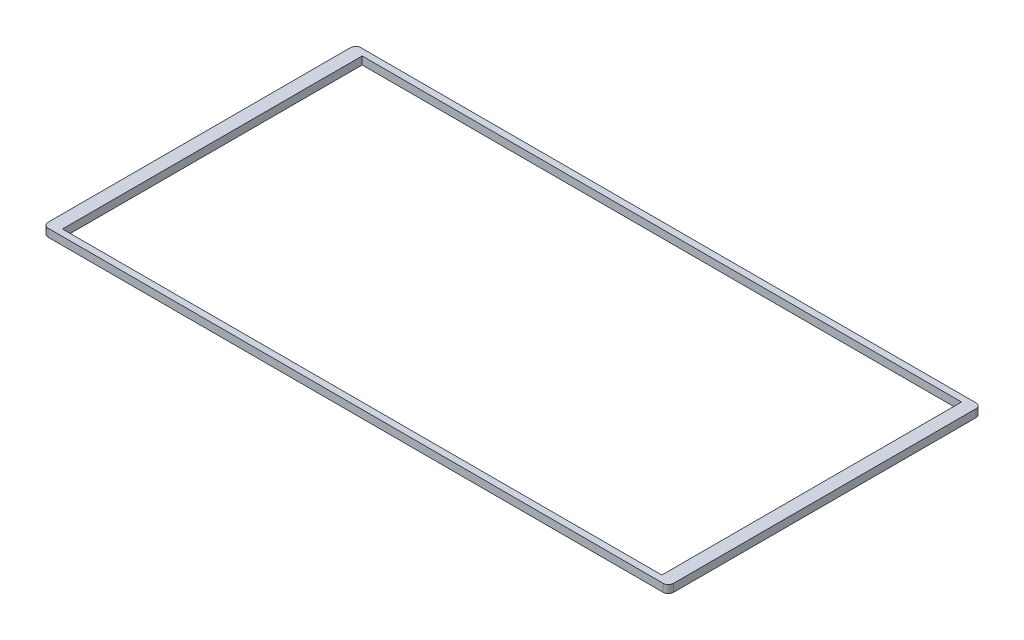
ISO-10303-21;
HEADER;
FILE_DESCRIPTION(('STEP AP214'),'2;1');
FILE_NAME('part.step','',(''),(''),'','','');
FILE_SCHEMA(('AUTOMOTIVE_DESIGN { 1 0 10303 214 1 1 1 1 }'));
ENDSEC;
DATA;
#1=APPLICATION_CONTEXT('core data for automotive mechanical design processes');
#2=APPLICATION_PROTOCOL_DEFINITION('international standard','automotive_design',2000,#1);
#3=PRODUCT_CONTEXT('',#1,'mechanical');
#4=PRODUCT('Part','Part','',(#3));
#5=PRODUCT_RELATED_PRODUCT_CATEGORY('part','',(#4));
#6=PRODUCT_DEFINITION_FORMATION('','',#4);
#7=PRODUCT_DEFINITION_CONTEXT('part definition',#1,'design');
#8=PRODUCT_DEFINITION('design','',#6,#7);
#9=PRODUCT_DEFINITION_SHAPE('','',#8);
#10=(LENGTH_UNIT() NAMED_UNIT(*) SI_UNIT(.MILLI.,.METRE.));
#11=(NAMED_UNIT(*) PLANE_ANGLE_UNIT() SI_UNIT($,.RADIAN.));
#12=(NAMED_UNIT(*) SI_UNIT($,.STERADIAN.) SOLID_ANGLE_UNIT());
#13=UNCERTAINTY_MEASURE_WITH_UNIT(LENGTH_MEASURE(1.E-05),#10,'distance_accuracy_value','');
#14=(GEOMETRIC_REPRESENTATION_CONTEXT(3) GLOBAL_UNCERTAINTY_ASSIGNED_CONTEXT((#13)) GLOBAL_UNIT_ASSIGNED_CONTEXT((#10,
#11,#12)) REPRESENTATION_CONTEXT('',''));
#15=CARTESIAN_POINT('',(0.,0.,0.));
#16=DIRECTION('',(0.,0.,1.));
#17=DIRECTION('',(1.,0.,0.));
#18=AXIS2_PLACEMENT_3D('',#15,#16,#17);
#19=CARTESIAN_POINT('',(0.,15.,0.));
#20=DIRECTION('',(0.,-1.,0.));
#21=DIRECTION('',(0.,0.,-1.));
#22=AXIS2_PLACEMENT_3D('',#19,#20,#21);
#23=PLANE('',#22);
#24=DIRECTION('',(-1.,0.,0.));
#25=VECTOR('',#24,1.);
#26=CARTESIAN_POINT('',(-1200.,15.,-600.));
#27=LINE('',#26,#25);
#28=CARTESIAN_POINT('',(1180.,15.,-600.));
#29=VERTEX_POINT('',#28);
#30=CARTESIAN_POINT('',(-1180.,15.,-600.));
#31=VERTEX_POINT('',#30);
#32=EDGE_CURVE('E166',#29,#31,#27,.T.);
#33=ORIENTED_EDGE('',*,*,#32,.T.);
#34=CARTESIAN_POINT('',(-1180.,15.,-580.));
#35=DIRECTION('',(0.,-1.,0.));
#36=DIRECTION('',(0.,0.,-1.));
#37=AXIS2_PLACEMENT_3D('',#34,#35,#36);
#38=CIRCLE('',#37,20.);
#39=CARTESIAN_POINT('',(-1200.,15.,-580.));
#40=VERTEX_POINT('',#39);
#41=EDGE_CURVE('E206',#31,#40,#38,.F.);
#42=ORIENTED_EDGE('',*,*,#41,.T.);
#43=DIRECTION('',(0.,0.,1.));
#44=VECTOR('',#43,1.);
#45=CARTESIAN_POINT('',(-1200.,15.,600.));
#46=LINE('',#45,#44);
#47=CARTESIAN_POINT('',(-1200.,15.,580.));
#48=VERTEX_POINT('',#47);
#49=EDGE_CURVE('E170',#40,#48,#46,.T.);
#50=ORIENTED_EDGE('',*,*,#49,.T.);
#51=CARTESIAN_POINT('',(-1180.,15.,580.));
#52=DIRECTION('',(0.,-1.,0.));
#53=DIRECTION('',(0.,0.,-1.));
#54=AXIS2_PLACEMENT_3D('',#51,#52,#53);
#55=CIRCLE('',#54,20.);
#56=CARTESIAN_POINT('',(-1180.,15.,600.));
#57=VERTEX_POINT('',#56);
#58=EDGE_CURVE('E52',#48,#57,#55,.F.);
#59=ORIENTED_EDGE('',*,*,#58,.T.);
#60=DIRECTION('',(1.,0.,0.));
#61=VECTOR('',#60,1.);
#62=CARTESIAN_POINT('',(-1200.,15.,600.));
#63=LINE('',#62,#61);
#64=CARTESIAN_POINT('',(1180.,15.,600.));
#65=VERTEX_POINT('',#64);
#66=EDGE_CURVE('E172',#57,#65,#63,.T.);
#67=ORIENTED_EDGE('',*,*,#66,.T.);
#68=CARTESIAN_POINT('',(1180.,15.,580.));
#69=DIRECTION('',(0.,-1.,0.));
#70=DIRECTION('',(0.,0.,-1.));
#71=AXIS2_PLACEMENT_3D('',#68,#69,#70);
#72=CIRCLE('',#71,20.);
#73=CARTESIAN_POINT('',(1200.,15.,580.));
#74=VERTEX_POINT('',#73);
#75=EDGE_CURVE('E202',#65,#74,#72,.F.);
#76=ORIENTED_EDGE('',*,*,#75,.T.);
#77=DIRECTION('',(0.,0.,-1.));
#78=VECTOR('',#77,1.);
#79=CARTESIAN_POINT('',(1200.,15.,600.));
#80=LINE('',#79,#78);
#81=CARTESIAN_POINT('',(1200.,15.,-580.));
#82=VERTEX_POINT('',#81);
#83=EDGE_CURVE('E163',#74,#82,#80,.T.);
#84=ORIENTED_EDGE('',*,*,#83,.T.);
#85=CARTESIAN_POINT('',(1180.,15.,-580.));
#86=DIRECTION('',(0.,-1.,0.));
#87=DIRECTION('',(0.,0.,-1.));
#88=AXIS2_PLACEMENT_3D('',#85,#86,#87);
#89=CIRCLE('',#88,20.);
#90=EDGE_CURVE('E204',#82,#29,#89,.F.);
#91=ORIENTED_EDGE('',*,*,#90,.T.);
#92=EDGE_LOOP('',(#33,#42,#50,#59,#67,#76,#84,#91));
#93=FACE_BOUND('',#92,.T.);
#94=DIRECTION('',(0.,0.,-1.));
#95=VECTOR('',#94,1.);
#96=CARTESIAN_POINT('',(1150.,15.,575.));
#97=LINE('',#96,#95);
#98=CARTESIAN_POINT('',(1150.,15.,575.));
#99=VERTEX_POINT('',#98);
#100=CARTESIAN_POINT('',(1150.,15.,-575.));
#101=VERTEX_POINT('',#100);
#102=EDGE_CURVE('E122',#99,#101,#97,.T.);
#103=ORIENTED_EDGE('',*,*,#102,.F.);
#104=DIRECTION('',(1.,0.,0.));
#105=VECTOR('',#104,1.);
#106=CARTESIAN_POINT('',(-1150.,15.,575.));
#107=LINE('',#106,#105);
#108=CARTESIAN_POINT('',(-1150.,15.,575.));
#109=VERTEX_POINT('',#108);
#110=EDGE_CURVE('E147',#109,#99,#107,.T.);
#111=ORIENTED_EDGE('',*,*,#110,.F.);
#112=DIRECTION('',(0.,0.,1.));
#113=VECTOR('',#112,1.);
#114=CARTESIAN_POINT('',(-1150.,15.,575.));
#115=LINE('',#114,#113);
#116=CARTESIAN_POINT('',(-1150.,15.,-575.));
#117=VERTEX_POINT('',#116);
#118=EDGE_CURVE('E145',#117,#109,#115,.T.);
#119=ORIENTED_EDGE('',*,*,#118,.F.);
#120=DIRECTION('',(-1.,0.,0.));
#121=VECTOR('',#120,1.);
#122=CARTESIAN_POINT('',(-1150.,15.,-575.));
#123=LINE('',#122,#121);
#124=EDGE_CURVE('E132',#101,#117,#123,.T.);
#125=ORIENTED_EDGE('',*,*,#124,.F.);
#126=EDGE_LOOP('',(#103,#111,#119,#125));
#127=FACE_BOUND('',#126,.T.);
#128=ADVANCED_FACE('F32',(#93,#127),#23,.F.);
#129=CARTESIAN_POINT('',(0.,-15.,0.));
#130=DIRECTION('',(0.,-1.,0.));
#131=DIRECTION('',(0.,0.,-1.));
#132=AXIS2_PLACEMENT_3D('',#129,#130,#131);
#133=PLANE('',#132);
#134=DIRECTION('',(0.,0.,1.));
#135=VECTOR('',#134,1.);
#136=CARTESIAN_POINT('',(-1200.,-15.,600.));
#137=LINE('',#136,#135);
#138=CARTESIAN_POINT('',(-1200.,-15.,-580.));
#139=VERTEX_POINT('',#138);
#140=CARTESIAN_POINT('',(-1200.,-15.,580.));
#141=VERTEX_POINT('',#140);
#142=EDGE_CURVE('E180',#139,#141,#137,.T.);
#143=ORIENTED_EDGE('',*,*,#142,.F.);
#144=CARTESIAN_POINT('',(-1180.,-15.,-580.));
#145=DIRECTION('',(0.,-1.,0.));
#146=DIRECTION('',(0.,0.,-1.));
#147=AXIS2_PLACEMENT_3D('',#144,#145,#146);
#148=CIRCLE('',#147,20.);
#149=CARTESIAN_POINT('',(-1180.,-15.,-600.));
#150=VERTEX_POINT('',#149);
#151=EDGE_CURVE('E194',#139,#150,#148,.T.);
#152=ORIENTED_EDGE('',*,*,#151,.T.);
#153=DIRECTION('',(-1.,0.,0.));
#154=VECTOR('',#153,1.);
#155=CARTESIAN_POINT('',(-1200.,-15.,-600.));
#156=LINE('',#155,#154);
#157=CARTESIAN_POINT('',(1180.,-15.,-600.));
#158=VERTEX_POINT('',#157);
#159=EDGE_CURVE('E177',#158,#150,#156,.T.);
#160=ORIENTED_EDGE('',*,*,#159,.F.);
#161=CARTESIAN_POINT('',(1180.,-15.,-580.));
#162=DIRECTION('',(0.,-1.,0.));
#163=DIRECTION('',(0.,0.,-1.));
#164=AXIS2_PLACEMENT_3D('',#161,#162,#163);
#165=CIRCLE('',#164,20.);
#166=CARTESIAN_POINT('',(1200.,-15.,-580.));
#167=VERTEX_POINT('',#166);
#168=EDGE_CURVE('E192',#158,#167,#165,.T.);
#169=ORIENTED_EDGE('',*,*,#168,.T.);
#170=DIRECTION('',(0.,0.,-1.));
#171=VECTOR('',#170,1.);
#172=CARTESIAN_POINT('',(1200.,-15.,600.));
#173=LINE('',#172,#171);
#174=CARTESIAN_POINT('',(1200.,-15.,580.));
#175=VERTEX_POINT('',#174);
#176=EDGE_CURVE('E140',#175,#167,#173,.T.);
#177=ORIENTED_EDGE('',*,*,#176,.F.);
#178=CARTESIAN_POINT('',(1180.,-15.,580.));
#179=DIRECTION('',(0.,-1.,0.));
#180=DIRECTION('',(0.,0.,-1.));
#181=AXIS2_PLACEMENT_3D('',#178,#179,#180);
#182=CIRCLE('',#181,20.);
#183=CARTESIAN_POINT('',(1180.,-15.,600.));
#184=VERTEX_POINT('',#183);
#185=EDGE_CURVE('E190',#175,#184,#182,.T.);
#186=ORIENTED_EDGE('',*,*,#185,.T.);
#187=DIRECTION('',(1.,0.,0.));
#188=VECTOR('',#187,1.);
#189=CARTESIAN_POINT('',(-1200.,-15.,600.));
#190=LINE('',#189,#188);
#191=CARTESIAN_POINT('',(-1180.,-15.,600.));
#192=VERTEX_POINT('',#191);
#193=EDGE_CURVE('E167',#192,#184,#190,.T.);
#194=ORIENTED_EDGE('',*,*,#193,.F.);
#195=CARTESIAN_POINT('',(-1180.,-15.,580.));
#196=DIRECTION('',(0.,-1.,0.));
#197=DIRECTION('',(0.,0.,-1.));
#198=AXIS2_PLACEMENT_3D('',#195,#196,#197);
#199=CIRCLE('',#198,20.);
#200=EDGE_CURVE('E188',#192,#141,#199,.T.);
#201=ORIENTED_EDGE('',*,*,#200,.T.);
#202=EDGE_LOOP('',(#143,#152,#160,#169,#177,#186,#194,#201));
#203=FACE_BOUND('',#202,.T.);
#204=DIRECTION('',(1.,0.,0.));
#205=VECTOR('',#204,1.);
#206=CARTESIAN_POINT('',(-1150.,-15.,575.));
#207=LINE('',#206,#205);
#208=CARTESIAN_POINT('',(-1150.,-15.,575.));
#209=VERTEX_POINT('',#208);
#210=CARTESIAN_POINT('',(1150.,-15.,575.));
#211=VERTEX_POINT('',#210);
#212=EDGE_CURVE('E133',#209,#211,#207,.T.);
#213=ORIENTED_EDGE('',*,*,#212,.T.);
#214=DIRECTION('',(0.,0.,-1.));
#215=VECTOR('',#214,1.);
#216=CARTESIAN_POINT('',(1150.,-15.,575.));
#217=LINE('',#216,#215);
#218=CARTESIAN_POINT('',(1150.,-15.,-575.));
#219=VERTEX_POINT('',#218);
#220=EDGE_CURVE('E151',#211,#219,#217,.T.);
#221=ORIENTED_EDGE('',*,*,#220,.T.);
#222=DIRECTION('',(-1.,0.,0.));
#223=VECTOR('',#222,1.);
#224=CARTESIAN_POINT('',(-1150.,-15.,-575.));
#225=LINE('',#224,#223);
#226=CARTESIAN_POINT('',(-1150.,-15.,-575.));
#227=VERTEX_POINT('',#226);
#228=EDGE_CURVE('E139',#219,#227,#225,.T.);
#229=ORIENTED_EDGE('',*,*,#228,.T.);
#230=DIRECTION('',(0.,0.,1.));
#231=VECTOR('',#230,1.);
#232=CARTESIAN_POINT('',(-1150.,-15.,575.));
#233=LINE('',#232,#231);
#234=EDGE_CURVE('E154',#227,#209,#233,.T.);
#235=ORIENTED_EDGE('',*,*,#234,.T.);
#236=EDGE_LOOP('',(#213,#221,#229,#235));
#237=FACE_BOUND('',#236,.T.);
#238=ADVANCED_FACE('F219',(#203,#237),#133,.T.);
#239=CARTESIAN_POINT('',(1200.,15.,600.));
#240=DIRECTION('',(-1.,0.,0.));
#241=DIRECTION('',(0.,0.,1.));
#242=AXIS2_PLACEMENT_3D('',#239,#240,#241);
#243=PLANE('',#242);
#244=ORIENTED_EDGE('',*,*,#176,.T.);
#245=DIRECTION('',(0.,-1.,0.));
#246=VECTOR('',#245,1.);
#247=CARTESIAN_POINT('',(1200.,15.,-580.));
#248=LINE('',#247,#246);
#249=EDGE_CURVE('E211',#167,#82,#248,.F.);
#250=ORIENTED_EDGE('',*,*,#249,.T.);
#251=ORIENTED_EDGE('',*,*,#83,.F.);
#252=DIRECTION('',(0.,-1.,0.));
#253=VECTOR('',#252,1.);
#254=CARTESIAN_POINT('',(1200.,15.,580.));
#255=LINE('',#254,#253);
#256=EDGE_CURVE('E208',#74,#175,#255,.T.);
#257=ORIENTED_EDGE('',*,*,#256,.T.);
#258=EDGE_LOOP('',(#244,#250,#251,#257));
#259=FACE_BOUND('',#258,.T.);
#260=ADVANCED_FACE('F228',(#259),#243,.F.);
#261=CARTESIAN_POINT('',(-1200.,15.,-600.));
#262=DIRECTION('',(0.,0.,1.));
#263=DIRECTION('',(1.,0.,0.));
#264=AXIS2_PLACEMENT_3D('',#261,#262,#263);
#265=PLANE('',#264);
#266=ORIENTED_EDGE('',*,*,#159,.T.);
#267=DIRECTION('',(0.,-1.,0.));
#268=VECTOR('',#267,1.);
#269=CARTESIAN_POINT('',(-1180.,15.,-600.));
#270=LINE('',#269,#268);
#271=EDGE_CURVE('E199',#150,#31,#270,.F.);
#272=ORIENTED_EDGE('',*,*,#271,.T.);
#273=ORIENTED_EDGE('',*,*,#32,.F.);
#274=DIRECTION('',(0.,-1.,0.));
#275=VECTOR('',#274,1.);
#276=CARTESIAN_POINT('',(1180.,15.,-600.));
#277=LINE('',#276,#275);
#278=EDGE_CURVE('E196',#29,#158,#277,.T.);
#279=ORIENTED_EDGE('',*,*,#278,.T.);
#280=EDGE_LOOP('',(#266,#272,#273,#279));
#281=FACE_BOUND('',#280,.T.);
#282=ADVANCED_FACE('F237',(#281),#265,.F.);
#283=CARTESIAN_POINT('',(-1200.,15.,600.));
#284=DIRECTION('',(1.,0.,0.));
#285=DIRECTION('',(0.,0.,-1.));
#286=AXIS2_PLACEMENT_3D('',#283,#284,#285);
#287=PLANE('',#286);
#288=ORIENTED_EDGE('',*,*,#49,.F.);
#289=DIRECTION('',(0.,-1.,0.));
#290=VECTOR('',#289,1.);
#291=CARTESIAN_POINT('',(-1200.,15.,-580.));
#292=LINE('',#291,#290);
#293=EDGE_CURVE('E185',#40,#139,#292,.T.);
#294=ORIENTED_EDGE('',*,*,#293,.T.);
#295=ORIENTED_EDGE('',*,*,#142,.T.);
#296=DIRECTION('',(0.,-1.,0.));
#297=VECTOR('',#296,1.);
#298=CARTESIAN_POINT('',(-1200.,15.,580.));
#299=LINE('',#298,#297);
#300=EDGE_CURVE('E174',#141,#48,#299,.F.);
#301=ORIENTED_EDGE('',*,*,#300,.T.);
#302=EDGE_LOOP('',(#288,#294,#295,#301));
#303=FACE_BOUND('',#302,.T.);
#304=ADVANCED_FACE('F245',(#303),#287,.F.);
#305=CARTESIAN_POINT('',(-1200.,15.,600.));
#306=DIRECTION('',(0.,0.,-1.));
#307=DIRECTION('',(-1.,0.,0.));
#308=AXIS2_PLACEMENT_3D('',#305,#306,#307);
#309=PLANE('',#308);
#310=ORIENTED_EDGE('',*,*,#193,.T.);
#311=DIRECTION('',(0.,-1.,0.));
#312=VECTOR('',#311,1.);
#313=CARTESIAN_POINT('',(1180.,15.,600.));
#314=LINE('',#313,#312);
#315=EDGE_CURVE('E11',#184,#65,#314,.F.);
#316=ORIENTED_EDGE('',*,*,#315,.T.);
#317=ORIENTED_EDGE('',*,*,#66,.F.);
#318=DIRECTION('',(0.,-1.,0.));
#319=VECTOR('',#318,1.);
#320=CARTESIAN_POINT('',(-1180.,15.,600.));
#321=LINE('',#320,#319);
#322=EDGE_CURVE('E40',#57,#192,#321,.T.);
#323=ORIENTED_EDGE('',*,*,#322,.T.);
#324=EDGE_LOOP('',(#310,#316,#317,#323));
#325=FACE_BOUND('',#324,.T.);
#326=ADVANCED_FACE('F215',(#325),#309,.F.);
#327=CARTESIAN_POINT('',(1150.,15.,575.));
#328=DIRECTION('',(-1.,0.,0.));
#329=DIRECTION('',(0.,0.,1.));
#330=AXIS2_PLACEMENT_3D('',#327,#328,#329);
#331=PLANE('',#330);
#332=ORIENTED_EDGE('',*,*,#220,.F.);
#333=DIRECTION('',(0.,-1.,0.));
#334=VECTOR('',#333,1.);
#335=CARTESIAN_POINT('',(1150.,15.,575.));
#336=LINE('',#335,#334);
#337=EDGE_CURVE('E128',#99,#211,#336,.T.);
#338=ORIENTED_EDGE('',*,*,#337,.F.);
#339=ORIENTED_EDGE('',*,*,#102,.T.);
#340=DIRECTION('',(0.,-1.,0.));
#341=VECTOR('',#340,1.);
#342=CARTESIAN_POINT('',(1150.,15.,-575.));
#343=LINE('',#342,#341);
#344=EDGE_CURVE('E125',#101,#219,#343,.T.);
#345=ORIENTED_EDGE('',*,*,#344,.T.);
#346=EDGE_LOOP('',(#332,#338,#339,#345));
#347=FACE_BOUND('',#346,.T.);
#348=ADVANCED_FACE('F124',(#347),#331,.T.);
#349=CARTESIAN_POINT('',(-1150.,15.,-575.));
#350=DIRECTION('',(0.,0.,1.));
#351=DIRECTION('',(1.,0.,0.));
#352=AXIS2_PLACEMENT_3D('',#349,#350,#351);
#353=PLANE('',#352);
#354=ORIENTED_EDGE('',*,*,#228,.F.);
#355=ORIENTED_EDGE('',*,*,#344,.F.);
#356=ORIENTED_EDGE('',*,*,#124,.T.);
#357=DIRECTION('',(0.,-1.,0.));
#358=VECTOR('',#357,1.);
#359=CARTESIAN_POINT('',(-1150.,15.,-575.));
#360=LINE('',#359,#358);
#361=EDGE_CURVE('E141',#117,#227,#360,.T.);
#362=ORIENTED_EDGE('',*,*,#361,.T.);
#363=EDGE_LOOP('',(#354,#355,#356,#362));
#364=FACE_BOUND('',#363,.T.);
#365=ADVANCED_FACE('F136',(#364),#353,.T.);
#366=CARTESIAN_POINT('',(-1150.,15.,575.));
#367=DIRECTION('',(1.,0.,0.));
#368=DIRECTION('',(0.,0.,-1.));
#369=AXIS2_PLACEMENT_3D('',#366,#367,#368);
#370=PLANE('',#369);
#371=ORIENTED_EDGE('',*,*,#234,.F.);
#372=ORIENTED_EDGE('',*,*,#361,.F.);
#373=ORIENTED_EDGE('',*,*,#118,.T.);
#374=DIRECTION('',(0.,-1.,0.));
#375=VECTOR('',#374,1.);
#376=CARTESIAN_POINT('',(-1150.,15.,575.));
#377=LINE('',#376,#375);
#378=EDGE_CURVE('E160',#109,#209,#377,.T.);
#379=ORIENTED_EDGE('',*,*,#378,.T.);
#380=EDGE_LOOP('',(#371,#372,#373,#379));
#381=FACE_BOUND('',#380,.T.);
#382=ADVANCED_FACE('F301',(#381),#370,.T.);
#383=CARTESIAN_POINT('',(-1150.,15.,575.));
#384=DIRECTION('',(0.,0.,-1.));
#385=DIRECTION('',(-1.,0.,0.));
#386=AXIS2_PLACEMENT_3D('',#383,#384,#385);
#387=PLANE('',#386);
#388=ORIENTED_EDGE('',*,*,#212,.F.);
#389=ORIENTED_EDGE('',*,*,#378,.F.);
#390=ORIENTED_EDGE('',*,*,#110,.T.);
#391=ORIENTED_EDGE('',*,*,#337,.T.);
#392=EDGE_LOOP('',(#388,#389,#390,#391));
#393=FACE_BOUND('',#392,.T.);
#394=ADVANCED_FACE('F270',(#393),#387,.T.);
#395=CARTESIAN_POINT('',(-1180.,15.,-580.));
#396=DIRECTION('',(0.,-1.,0.));
#397=DIRECTION('',(0.,0.,-1.));
#398=AXIS2_PLACEMENT_3D('',#395,#396,#397);
#399=CYLINDRICAL_SURFACE('',#398,20.);
#400=ORIENTED_EDGE('',*,*,#41,.F.);
#401=ORIENTED_EDGE('',*,*,#271,.F.);
#402=ORIENTED_EDGE('',*,*,#151,.F.);
#403=ORIENTED_EDGE('',*,*,#293,.F.);
#404=EDGE_LOOP('',(#400,#401,#402,#403));
#405=FACE_BOUND('',#404,.T.);
#406=ADVANCED_FACE('F242',(#405),#399,.T.);
#407=CARTESIAN_POINT('',(1180.,15.,-580.));
#408=DIRECTION('',(0.,-1.,0.));
#409=DIRECTION('',(0.,0.,-1.));
#410=AXIS2_PLACEMENT_3D('',#407,#408,#409);
#411=CYLINDRICAL_SURFACE('',#410,20.);
#412=ORIENTED_EDGE('',*,*,#90,.F.);
#413=ORIENTED_EDGE('',*,*,#249,.F.);
#414=ORIENTED_EDGE('',*,*,#168,.F.);
#415=ORIENTED_EDGE('',*,*,#278,.F.);
#416=EDGE_LOOP('',(#412,#413,#414,#415));
#417=FACE_BOUND('',#416,.T.);
#418=ADVANCED_FACE('F234',(#417),#411,.T.);
#419=CARTESIAN_POINT('',(1180.,15.,580.));
#420=DIRECTION('',(0.,-1.,0.));
#421=DIRECTION('',(0.,0.,-1.));
#422=AXIS2_PLACEMENT_3D('',#419,#420,#421);
#423=CYLINDRICAL_SURFACE('',#422,20.);
#424=ORIENTED_EDGE('',*,*,#75,.F.);
#425=ORIENTED_EDGE('',*,*,#315,.F.);
#426=ORIENTED_EDGE('',*,*,#185,.F.);
#427=ORIENTED_EDGE('',*,*,#256,.F.);
#428=EDGE_LOOP('',(#424,#425,#426,#427));
#429=FACE_BOUND('',#428,.T.);
#430=ADVANCED_FACE('F225',(#429),#423,.T.);
#431=CARTESIAN_POINT('',(-1180.,15.,580.));
#432=DIRECTION('',(0.,-1.,0.));
#433=DIRECTION('',(0.,0.,-1.));
#434=AXIS2_PLACEMENT_3D('',#431,#432,#433);
#435=CYLINDRICAL_SURFACE('',#434,20.);
#436=ORIENTED_EDGE('',*,*,#58,.F.);
#437=ORIENTED_EDGE('',*,*,#300,.F.);
#438=ORIENTED_EDGE('',*,*,#200,.F.);
#439=ORIENTED_EDGE('',*,*,#322,.F.);
#440=EDGE_LOOP('',(#436,#437,#438,#439));
#441=FACE_BOUND('',#440,.T.);
#442=ADVANCED_FACE('F34',(#441),#435,.T.);
#443=CLOSED_SHELL('',(#128,#238,#260,#282,#304,#326,#348,#365,#382,#394,#406,#418,#430,#442));
#444=MANIFOLD_SOLID_BREP('B2',#443);
#445=ADVANCED_BREP_SHAPE_REPRESENTATION('',(#18,#444),#14);
#446=SHAPE_DEFINITION_REPRESENTATION(#9,#445);
ENDSEC;
END-ISO-10303-21;
